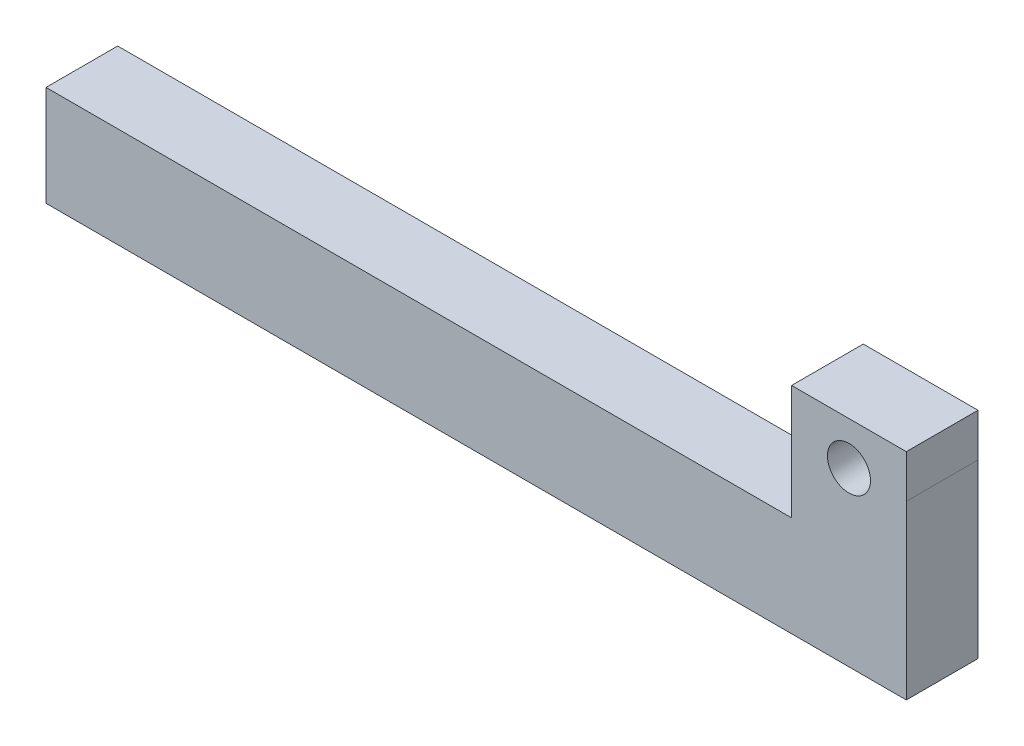
ISO-10303-21;
HEADER;
FILE_DESCRIPTION(('STEP AP214'),'2;1');
FILE_NAME('part.step','',(''),(''),'','','');
FILE_SCHEMA(('AUTOMOTIVE_DESIGN { 1 0 10303 214 1 1 1 1 }'));
ENDSEC;
DATA;
#1=APPLICATION_CONTEXT('core data for automotive mechanical design processes');
#2=APPLICATION_PROTOCOL_DEFINITION('international standard','automotive_design',2000,#1);
#3=PRODUCT_CONTEXT('',#1,'mechanical');
#4=PRODUCT('Part','Part','',(#3));
#5=PRODUCT_RELATED_PRODUCT_CATEGORY('part','',(#4));
#6=PRODUCT_DEFINITION_FORMATION('','',#4);
#7=PRODUCT_DEFINITION_CONTEXT('part definition',#1,'design');
#8=PRODUCT_DEFINITION('design','',#6,#7);
#9=PRODUCT_DEFINITION_SHAPE('','',#8);
#10=(LENGTH_UNIT() NAMED_UNIT(*) SI_UNIT(.MILLI.,.METRE.));
#11=(NAMED_UNIT(*) PLANE_ANGLE_UNIT() SI_UNIT($,.RADIAN.));
#12=(NAMED_UNIT(*) SI_UNIT($,.STERADIAN.) SOLID_ANGLE_UNIT());
#13=UNCERTAINTY_MEASURE_WITH_UNIT(LENGTH_MEASURE(1.E-05),#10,'distance_accuracy_value','');
#14=(GEOMETRIC_REPRESENTATION_CONTEXT(3) GLOBAL_UNCERTAINTY_ASSIGNED_CONTEXT((#13)) GLOBAL_UNIT_ASSIGNED_CONTEXT((#10,
#11,#12)) REPRESENTATION_CONTEXT('',''));
#15=CARTESIAN_POINT('',(0.,0.,0.));
#16=DIRECTION('',(0.,0.,1.));
#17=DIRECTION('',(1.,0.,0.));
#18=AXIS2_PLACEMENT_3D('',#15,#16,#17);
#19=CARTESIAN_POINT('',(300.,0.,25.));
#20=DIRECTION('',(-1.,0.,0.));
#21=DIRECTION('',(0.,0.,1.));
#22=AXIS2_PLACEMENT_3D('',#19,#20,#21);
#23=PLANE('',#22);
#24=DIRECTION('',(0.,0.,-1.));
#25=VECTOR('',#24,1.);
#26=CARTESIAN_POINT('',(300.,60.,25.));
#27=LINE('',#26,#25);
#28=CARTESIAN_POINT('',(300.,60.,25.));
#29=VERTEX_POINT('',#28);
#30=CARTESIAN_POINT('',(300.,60.,0.));
#31=VERTEX_POINT('',#30);
#32=EDGE_CURVE('E12',#29,#31,#27,.T.);
#33=ORIENTED_EDGE('',*,*,#32,.F.);
#34=DIRECTION('',(0.,1.,0.));
#35=VECTOR('',#34,1.);
#36=CARTESIAN_POINT('',(300.,0.,25.));
#37=LINE('',#36,#35);
#38=CARTESIAN_POINT('',(300.,0.,25.));
#39=VERTEX_POINT('',#38);
#40=EDGE_CURVE('E156',#39,#29,#37,.T.);
#41=ORIENTED_EDGE('',*,*,#40,.F.);
#42=DIRECTION('',(0.,0.,-1.));
#43=VECTOR('',#42,1.);
#44=CARTESIAN_POINT('',(300.,0.,25.));
#45=LINE('',#44,#43);
#46=CARTESIAN_POINT('',(300.,0.,0.));
#47=VERTEX_POINT('',#46);
#48=EDGE_CURVE('E107',#39,#47,#45,.T.);
#49=ORIENTED_EDGE('',*,*,#48,.T.);
#50=DIRECTION('',(0.,1.,0.));
#51=VECTOR('',#50,1.);
#52=CARTESIAN_POINT('',(300.,0.,0.));
#53=LINE('',#52,#51);
#54=EDGE_CURVE('E143',#47,#31,#53,.T.);
#55=ORIENTED_EDGE('',*,*,#54,.T.);
#56=EDGE_LOOP('',(#33,#41,#49,#55));
#57=FACE_BOUND('',#56,.T.);
#58=ADVANCED_FACE('F44',(#57),#23,.F.);
#59=CARTESIAN_POINT('',(0.,35.,25.));
#60=DIRECTION('',(0.,0.,1.));
#61=DIRECTION('',(1.,0.,0.));
#62=AXIS2_PLACEMENT_3D('',#59,#60,#61);
#63=PLANE('',#62);
#64=DIRECTION('',(0.,-1.,0.));
#65=VECTOR('',#64,1.);
#66=CARTESIAN_POINT('',(0.,0.,25.));
#67=LINE('',#66,#65);
#68=CARTESIAN_POINT('',(0.,35.,25.));
#69=VERTEX_POINT('',#68);
#70=CARTESIAN_POINT('',(0.,0.,25.));
#71=VERTEX_POINT('',#70);
#72=EDGE_CURVE('E111',#69,#71,#67,.T.);
#73=ORIENTED_EDGE('',*,*,#72,.T.);
#74=DIRECTION('',(1.,0.,0.));
#75=VECTOR('',#74,1.);
#76=CARTESIAN_POINT('',(0.,0.,25.));
#77=LINE('',#76,#75);
#78=EDGE_CURVE('E101',#71,#39,#77,.T.);
#79=ORIENTED_EDGE('',*,*,#78,.T.);
#80=ORIENTED_EDGE('',*,*,#40,.T.);
#81=CARTESIAN_POINT('',(300.,75.,25.));
#82=VERTEX_POINT('',#81);
#83=EDGE_CURVE('E110',#29,#82,#37,.T.);
#84=ORIENTED_EDGE('',*,*,#83,.T.);
#85=DIRECTION('',(-1.,0.,0.));
#86=VECTOR('',#85,1.);
#87=CARTESIAN_POINT('',(300.,75.,25.));
#88=LINE('',#87,#86);
#89=CARTESIAN_POINT('',(260.,75.,25.));
#90=VERTEX_POINT('',#89);
#91=EDGE_CURVE('E152',#82,#90,#88,.T.);
#92=ORIENTED_EDGE('',*,*,#91,.T.);
#93=DIRECTION('',(0.,-1.,0.));
#94=VECTOR('',#93,1.);
#95=CARTESIAN_POINT('',(260.,35.,25.));
#96=LINE('',#95,#94);
#97=CARTESIAN_POINT('',(260.,35.,25.));
#98=VERTEX_POINT('',#97);
#99=EDGE_CURVE('E151',#90,#98,#96,.T.);
#100=ORIENTED_EDGE('',*,*,#99,.T.);
#101=DIRECTION('',(-1.,0.,0.));
#102=VECTOR('',#101,1.);
#103=CARTESIAN_POINT('',(260.,35.,25.));
#104=LINE('',#103,#102);
#105=EDGE_CURVE('E117',#98,#69,#104,.T.);
#106=ORIENTED_EDGE('',*,*,#105,.T.);
#107=EDGE_LOOP('',(#73,#79,#80,#84,#92,#100,#106));
#108=FACE_BOUND('',#107,.T.);
#109=CARTESIAN_POINT('',(280.,60.,25.));
#110=DIRECTION('',(0.,0.,1.));
#111=DIRECTION('',(1.,0.,0.));
#112=AXIS2_PLACEMENT_3D('',#109,#110,#111);
#113=CIRCLE('',#112,7.50000000000001);
#114=CARTESIAN_POINT('',(287.5,60.,25.));
#115=VERTEX_POINT('',#114);
#116=EDGE_CURVE('E149',#115,#115,#113,.T.);
#117=ORIENTED_EDGE('',*,*,#116,.F.);
#118=EDGE_LOOP('',(#117));
#119=FACE_BOUND('',#118,.T.);
#120=ADVANCED_FACE('F114',(#108,#119),#63,.T.);
#121=CARTESIAN_POINT('',(0.,35.,0.));
#122=DIRECTION('',(0.,0.,1.));
#123=DIRECTION('',(1.,0.,0.));
#124=AXIS2_PLACEMENT_3D('',#121,#122,#123);
#125=PLANE('',#124);
#126=DIRECTION('',(0.,-1.,0.));
#127=VECTOR('',#126,1.);
#128=CARTESIAN_POINT('',(0.,0.,0.));
#129=LINE('',#128,#127);
#130=CARTESIAN_POINT('',(0.,35.,0.));
#131=VERTEX_POINT('',#130);
#132=CARTESIAN_POINT('',(0.,0.,0.));
#133=VERTEX_POINT('',#132);
#134=EDGE_CURVE('E124',#131,#133,#129,.T.);
#135=ORIENTED_EDGE('',*,*,#134,.F.);
#136=DIRECTION('',(-1.,0.,0.));
#137=VECTOR('',#136,1.);
#138=CARTESIAN_POINT('',(260.,35.,0.));
#139=LINE('',#138,#137);
#140=CARTESIAN_POINT('',(260.,35.,0.));
#141=VERTEX_POINT('',#140);
#142=EDGE_CURVE('E121',#141,#131,#139,.T.);
#143=ORIENTED_EDGE('',*,*,#142,.F.);
#144=DIRECTION('',(0.,-1.,0.));
#145=VECTOR('',#144,1.);
#146=CARTESIAN_POINT('',(260.,35.,0.));
#147=LINE('',#146,#145);
#148=CARTESIAN_POINT('',(260.,75.,0.));
#149=VERTEX_POINT('',#148);
#150=EDGE_CURVE('E139',#149,#141,#147,.T.);
#151=ORIENTED_EDGE('',*,*,#150,.F.);
#152=DIRECTION('',(-1.,0.,0.));
#153=VECTOR('',#152,1.);
#154=CARTESIAN_POINT('',(300.,75.,0.));
#155=LINE('',#154,#153);
#156=CARTESIAN_POINT('',(300.,75.,0.));
#157=VERTEX_POINT('',#156);
#158=EDGE_CURVE('E141',#157,#149,#155,.T.);
#159=ORIENTED_EDGE('',*,*,#158,.F.);
#160=EDGE_CURVE('E145',#31,#157,#53,.T.);
#161=ORIENTED_EDGE('',*,*,#160,.F.);
#162=ORIENTED_EDGE('',*,*,#54,.F.);
#163=DIRECTION('',(1.,0.,0.));
#164=VECTOR('',#163,1.);
#165=CARTESIAN_POINT('',(0.,0.,0.));
#166=LINE('',#165,#164);
#167=EDGE_CURVE('E146',#133,#47,#166,.T.);
#168=ORIENTED_EDGE('',*,*,#167,.F.);
#169=EDGE_LOOP('',(#135,#143,#151,#159,#161,#162,#168));
#170=FACE_BOUND('',#169,.T.);
#171=CARTESIAN_POINT('',(280.,60.,0.));
#172=DIRECTION('',(0.,0.,1.));
#173=DIRECTION('',(1.,0.,0.));
#174=AXIS2_PLACEMENT_3D('',#171,#172,#173);
#175=CIRCLE('',#174,7.50000000000001);
#176=CARTESIAN_POINT('',(287.5,60.,0.));
#177=VERTEX_POINT('',#176);
#178=EDGE_CURVE('E158',#177,#177,#175,.T.);
#179=ORIENTED_EDGE('',*,*,#178,.T.);
#180=EDGE_LOOP('',(#179));
#181=FACE_BOUND('',#180,.T.);
#182=ADVANCED_FACE('F167',(#170,#181),#125,.F.);
#183=CARTESIAN_POINT('',(0.,0.,25.));
#184=DIRECTION('',(1.,0.,0.));
#185=DIRECTION('',(0.,0.,-1.));
#186=AXIS2_PLACEMENT_3D('',#183,#184,#185);
#187=PLANE('',#186);
#188=ORIENTED_EDGE('',*,*,#134,.T.);
#189=DIRECTION('',(0.,0.,-1.));
#190=VECTOR('',#189,1.);
#191=CARTESIAN_POINT('',(0.,0.,25.));
#192=LINE('',#191,#190);
#193=EDGE_CURVE('E53',#71,#133,#192,.T.);
#194=ORIENTED_EDGE('',*,*,#193,.F.);
#195=ORIENTED_EDGE('',*,*,#72,.F.);
#196=DIRECTION('',(0.,0.,-1.));
#197=VECTOR('',#196,1.);
#198=CARTESIAN_POINT('',(0.,35.,25.));
#199=LINE('',#198,#197);
#200=EDGE_CURVE('E136',#69,#131,#199,.T.);
#201=ORIENTED_EDGE('',*,*,#200,.T.);
#202=EDGE_LOOP('',(#188,#194,#195,#201));
#203=FACE_BOUND('',#202,.T.);
#204=ADVANCED_FACE('F46',(#203),#187,.F.);
#205=CARTESIAN_POINT('',(0.,0.,25.));
#206=DIRECTION('',(0.,1.,0.));
#207=DIRECTION('',(0.,0.,1.));
#208=AXIS2_PLACEMENT_3D('',#205,#206,#207);
#209=PLANE('',#208);
#210=ORIENTED_EDGE('',*,*,#167,.T.);
#211=ORIENTED_EDGE('',*,*,#48,.F.);
#212=ORIENTED_EDGE('',*,*,#78,.F.);
#213=ORIENTED_EDGE('',*,*,#193,.T.);
#214=EDGE_LOOP('',(#210,#211,#212,#213));
#215=FACE_BOUND('',#214,.T.);
#216=ADVANCED_FACE('F103',(#215),#209,.F.);
#217=ORIENTED_EDGE('',*,*,#83,.F.);
#218=ORIENTED_EDGE('',*,*,#32,.T.);
#219=ORIENTED_EDGE('',*,*,#160,.T.);
#220=DIRECTION('',(0.,0.,-1.));
#221=VECTOR('',#220,1.);
#222=CARTESIAN_POINT('',(300.,75.,25.));
#223=LINE('',#222,#221);
#224=EDGE_CURVE('E125',#82,#157,#223,.T.);
#225=ORIENTED_EDGE('',*,*,#224,.F.);
#226=EDGE_LOOP('',(#217,#218,#219,#225));
#227=FACE_BOUND('',#226,.T.);
#228=ADVANCED_FACE('F176',(#227),#23,.F.);
#229=CARTESIAN_POINT('',(300.,75.,25.));
#230=DIRECTION('',(0.,-1.,0.));
#231=DIRECTION('',(0.,0.,-1.));
#232=AXIS2_PLACEMENT_3D('',#229,#230,#231);
#233=PLANE('',#232);
#234=ORIENTED_EDGE('',*,*,#158,.T.);
#235=DIRECTION('',(0.,0.,-1.));
#236=VECTOR('',#235,1.);
#237=CARTESIAN_POINT('',(260.,75.,25.));
#238=LINE('',#237,#236);
#239=EDGE_CURVE('E130',#90,#149,#238,.T.);
#240=ORIENTED_EDGE('',*,*,#239,.F.);
#241=ORIENTED_EDGE('',*,*,#91,.F.);
#242=ORIENTED_EDGE('',*,*,#224,.T.);
#243=EDGE_LOOP('',(#234,#240,#241,#242));
#244=FACE_BOUND('',#243,.T.);
#245=ADVANCED_FACE('F186',(#244),#233,.F.);
#246=CARTESIAN_POINT('',(260.,35.,25.));
#247=DIRECTION('',(1.,0.,0.));
#248=DIRECTION('',(0.,0.,-1.));
#249=AXIS2_PLACEMENT_3D('',#246,#247,#248);
#250=PLANE('',#249);
#251=ORIENTED_EDGE('',*,*,#150,.T.);
#252=DIRECTION('',(0.,0.,-1.));
#253=VECTOR('',#252,1.);
#254=CARTESIAN_POINT('',(260.,35.,25.));
#255=LINE('',#254,#253);
#256=EDGE_CURVE('E133',#98,#141,#255,.T.);
#257=ORIENTED_EDGE('',*,*,#256,.F.);
#258=ORIENTED_EDGE('',*,*,#99,.F.);
#259=ORIENTED_EDGE('',*,*,#239,.T.);
#260=EDGE_LOOP('',(#251,#257,#258,#259));
#261=FACE_BOUND('',#260,.T.);
#262=ADVANCED_FACE('F182',(#261),#250,.F.);
#263=CARTESIAN_POINT('',(260.,35.,25.));
#264=DIRECTION('',(0.,-1.,0.));
#265=DIRECTION('',(1.,0.,0.));
#266=AXIS2_PLACEMENT_3D('',#263,#264,#265);
#267=PLANE('',#266);
#268=ORIENTED_EDGE('',*,*,#142,.T.);
#269=ORIENTED_EDGE('',*,*,#200,.F.);
#270=ORIENTED_EDGE('',*,*,#105,.F.);
#271=ORIENTED_EDGE('',*,*,#256,.T.);
#272=EDGE_LOOP('',(#268,#269,#270,#271));
#273=FACE_BOUND('',#272,.T.);
#274=ADVANCED_FACE('F179',(#273),#267,.F.);
#275=CARTESIAN_POINT('',(280.,60.,25.));
#276=DIRECTION('',(0.,0.,-1.));
#277=DIRECTION('',(-1.,0.,0.));
#278=AXIS2_PLACEMENT_3D('',#275,#276,#277);
#279=CYLINDRICAL_SURFACE('',#278,7.50000000000001);
#280=ORIENTED_EDGE('',*,*,#116,.T.);
#281=EDGE_LOOP('',(#280));
#282=FACE_BOUND('',#281,.T.);
#283=ORIENTED_EDGE('',*,*,#178,.F.);
#284=EDGE_LOOP('',(#283));
#285=FACE_BOUND('',#284,.T.);
#286=ADVANCED_FACE('F164',(#282,#285),#279,.F.);
#287=CLOSED_SHELL('',(#58,#120,#182,#204,#216,#228,#245,#262,#274,#286));
#288=MANIFOLD_SOLID_BREP('B2',#287);
#289=ADVANCED_BREP_SHAPE_REPRESENTATION('',(#18,#288),#14);
#290=SHAPE_DEFINITION_REPRESENTATION(#9,#289);
ENDSEC;
END-ISO-10303-21;
